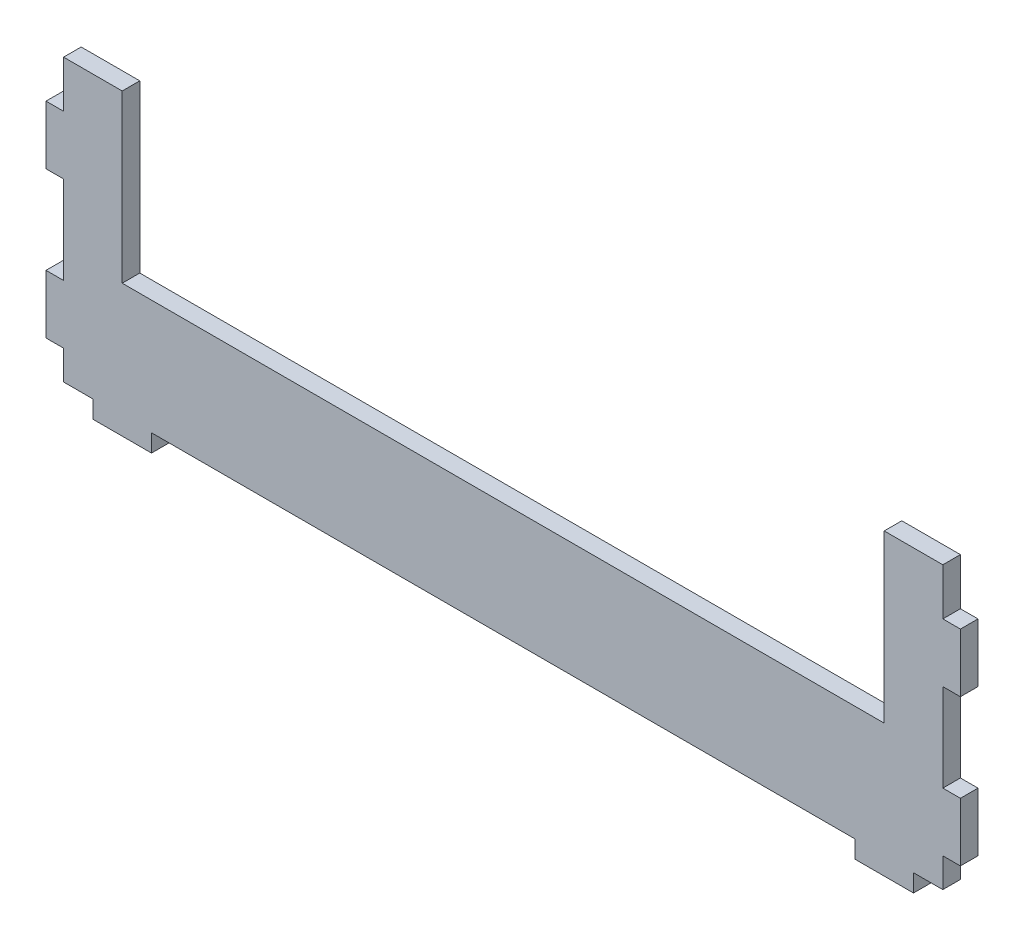
ISO-10303-21;
HEADER;
FILE_DESCRIPTION(('STEP AP214'),'2;1');
FILE_NAME('part.step','',(''),(''),'','','');
FILE_SCHEMA(('AUTOMOTIVE_DESIGN { 1 0 10303 214 1 1 1 1 }'));
ENDSEC;
DATA;
#1=APPLICATION_CONTEXT('core data for automotive mechanical design processes');
#2=APPLICATION_PROTOCOL_DEFINITION('international standard','automotive_design',2000,#1);
#3=PRODUCT_CONTEXT('',#1,'mechanical');
#4=PRODUCT('Part','Part','',(#3));
#5=PRODUCT_RELATED_PRODUCT_CATEGORY('part','',(#4));
#6=PRODUCT_DEFINITION_FORMATION('','',#4);
#7=PRODUCT_DEFINITION_CONTEXT('part definition',#1,'design');
#8=PRODUCT_DEFINITION('design','',#6,#7);
#9=PRODUCT_DEFINITION_SHAPE('','',#8);
#10=(LENGTH_UNIT() NAMED_UNIT(*) SI_UNIT(.MILLI.,.METRE.));
#11=(NAMED_UNIT(*) PLANE_ANGLE_UNIT() SI_UNIT($,.RADIAN.));
#12=(NAMED_UNIT(*) SI_UNIT($,.STERADIAN.) SOLID_ANGLE_UNIT());
#13=UNCERTAINTY_MEASURE_WITH_UNIT(LENGTH_MEASURE(1.E-05),#10,'distance_accuracy_value','');
#14=(GEOMETRIC_REPRESENTATION_CONTEXT(3) GLOBAL_UNCERTAINTY_ASSIGNED_CONTEXT((#13)) GLOBAL_UNIT_ASSIGNED_CONTEXT((#10,
#11,#12)) REPRESENTATION_CONTEXT('',''));
#15=CARTESIAN_POINT('',(0.,0.,0.));
#16=DIRECTION('',(0.,0.,1.));
#17=DIRECTION('',(1.,0.,0.));
#18=AXIS2_PLACEMENT_3D('',#15,#16,#17);
#19=CARTESIAN_POINT('',(0.,0.,0.));
#20=DIRECTION('',(0.,0.,-1.));
#21=DIRECTION('',(-1.,0.,0.));
#22=AXIS2_PLACEMENT_3D('',#19,#20,#21);
#23=PLANE('',#22);
#24=DIRECTION('',(0.,-1.,0.));
#25=VECTOR('',#24,1.);
#26=CARTESIAN_POINT('',(-495.568859933218,5.99999999999858,0.));
#27=LINE('',#26,#25);
#28=CARTESIAN_POINT('',(-495.568859933218,15.9999999984444,0.));
#29=VERTEX_POINT('',#28);
#30=CARTESIAN_POINT('',(-495.568859933218,5.99999999999858,0.));
#31=VERTEX_POINT('',#30);
#32=EDGE_CURVE('E253',#29,#31,#27,.T.);
#33=ORIENTED_EDGE('',*,*,#32,.F.);
#34=DIRECTION('',(1.,0.,0.));
#35=VECTOR('',#34,1.);
#36=CARTESIAN_POINT('',(-501.568859933218,15.9999999984444,0.));
#37=LINE('',#36,#35);
#38=CARTESIAN_POINT('',(-501.568859933218,15.9999999984444,0.));
#39=VERTEX_POINT('',#38);
#40=EDGE_CURVE('E349',#39,#29,#37,.T.);
#41=ORIENTED_EDGE('',*,*,#40,.F.);
#42=DIRECTION('',(0.,-1.,0.));
#43=VECTOR('',#42,1.);
#44=CARTESIAN_POINT('',(-501.568859933218,35.9999999984444,0.));
#45=LINE('',#44,#43);
#46=CARTESIAN_POINT('',(-501.568859933218,35.9999999984444,0.));
#47=VERTEX_POINT('',#46);
#48=EDGE_CURVE('E346',#47,#39,#45,.T.);
#49=ORIENTED_EDGE('',*,*,#48,.F.);
#50=DIRECTION('',(-1.,0.,0.));
#51=VECTOR('',#50,1.);
#52=CARTESIAN_POINT('',(-495.568859933218,35.9999999984444,0.));
#53=LINE('',#52,#51);
#54=CARTESIAN_POINT('',(-495.568859933218,35.9999999984444,0.));
#55=VERTEX_POINT('',#54);
#56=EDGE_CURVE('E343',#55,#47,#53,.T.);
#57=ORIENTED_EDGE('',*,*,#56,.F.);
#58=DIRECTION('',(0.,-1.,0.));
#59=VECTOR('',#58,1.);
#60=CARTESIAN_POINT('',(-495.568859933218,35.9999999984444,0.));
#61=LINE('',#60,#59);
#62=CARTESIAN_POINT('',(-495.568859933218,65.9999999984442,0.));
#63=VERTEX_POINT('',#62);
#64=EDGE_CURVE('E340',#63,#55,#61,.T.);
#65=ORIENTED_EDGE('',*,*,#64,.F.);
#66=DIRECTION('',(1.,0.,0.));
#67=VECTOR('',#66,1.);
#68=CARTESIAN_POINT('',(-501.568859933218,65.9999999984442,0.));
#69=LINE('',#68,#67);
#70=CARTESIAN_POINT('',(-501.568859933218,65.9999999984442,0.));
#71=VERTEX_POINT('',#70);
#72=EDGE_CURVE('E337',#71,#63,#69,.T.);
#73=ORIENTED_EDGE('',*,*,#72,.F.);
#74=DIRECTION('',(0.,-1.,0.));
#75=VECTOR('',#74,1.);
#76=CARTESIAN_POINT('',(-501.568859933218,85.9999999984442,0.));
#77=LINE('',#76,#75);
#78=CARTESIAN_POINT('',(-501.568859933218,85.9999999984442,0.));
#79=VERTEX_POINT('',#78);
#80=EDGE_CURVE('E334',#79,#71,#77,.T.);
#81=ORIENTED_EDGE('',*,*,#80,.F.);
#82=DIRECTION('',(-1.,0.,0.));
#83=VECTOR('',#82,1.);
#84=CARTESIAN_POINT('',(-495.568859933218,85.9999999984442,0.));
#85=LINE('',#84,#83);
#86=CARTESIAN_POINT('',(-495.568859933218,85.9999999984442,0.));
#87=VERTEX_POINT('',#86);
#88=EDGE_CURVE('E331',#87,#79,#85,.T.);
#89=ORIENTED_EDGE('',*,*,#88,.F.);
#90=DIRECTION('',(0.,-1.,0.));
#91=VECTOR('',#90,1.);
#92=CARTESIAN_POINT('',(-495.568859933218,85.9999999984442,0.));
#93=LINE('',#92,#91);
#94=CARTESIAN_POINT('',(-495.568859933218,102.000000000001,0.));
#95=VERTEX_POINT('',#94);
#96=EDGE_CURVE('E328',#95,#87,#93,.T.);
#97=ORIENTED_EDGE('',*,*,#96,.F.);
#98=DIRECTION('',(-1.,0.,0.));
#99=VECTOR('',#98,1.);
#100=CARTESIAN_POINT('',(-495.568859933218,102.000000000001,0.));
#101=LINE('',#100,#99);
#102=CARTESIAN_POINT('',(-475.568859933233,102.,0.));
#103=VERTEX_POINT('',#102);
#104=EDGE_CURVE('E325',#103,#95,#101,.T.);
#105=ORIENTED_EDGE('',*,*,#104,.F.);
#106=DIRECTION('',(0.,1.,0.));
#107=VECTOR('',#106,1.);
#108=CARTESIAN_POINT('',(-475.568859933233,102.,0.));
#109=LINE('',#108,#107);
#110=CARTESIAN_POINT('',(-475.568859933233,45.1999999999997,0.));
#111=VERTEX_POINT('',#110);
#112=EDGE_CURVE('E322',#111,#103,#109,.T.);
#113=ORIENTED_EDGE('',*,*,#112,.F.);
#114=DIRECTION('',(-1.,0.,0.));
#115=VECTOR('',#114,1.);
#116=CARTESIAN_POINT('',(-475.568859933233,45.1999999999997,0.));
#117=LINE('',#116,#115);
#118=CARTESIAN_POINT('',(-215.568859933231,45.2000000000004,0.));
#119=VERTEX_POINT('',#118);
#120=EDGE_CURVE('E319',#119,#111,#117,.T.);
#121=ORIENTED_EDGE('',*,*,#120,.F.);
#122=DIRECTION('',(0.,-1.,0.));
#123=VECTOR('',#122,1.);
#124=CARTESIAN_POINT('',(-215.568859933231,102.000000000001,0.));
#125=LINE('',#124,#123);
#126=CARTESIAN_POINT('',(-215.568859933231,102.000000000001,0.));
#127=VERTEX_POINT('',#126);
#128=EDGE_CURVE('E316',#127,#119,#125,.T.);
#129=ORIENTED_EDGE('',*,*,#128,.F.);
#130=DIRECTION('',(-1.,0.,0.));
#131=VECTOR('',#130,1.);
#132=CARTESIAN_POINT('',(-215.568859933231,102.000000000001,0.));
#133=LINE('',#132,#131);
#134=CARTESIAN_POINT('',(-195.568859933246,102.,0.));
#135=VERTEX_POINT('',#134);
#136=EDGE_CURVE('E313',#135,#127,#133,.T.);
#137=ORIENTED_EDGE('',*,*,#136,.F.);
#138=DIRECTION('',(0.,1.,0.));
#139=VECTOR('',#138,1.);
#140=CARTESIAN_POINT('',(-195.568859933246,86.0000000000003,0.));
#141=LINE('',#140,#139);
#142=CARTESIAN_POINT('',(-195.568859933246,86.0000000000003,0.));
#143=VERTEX_POINT('',#142);
#144=EDGE_CURVE('E310',#143,#135,#141,.T.);
#145=ORIENTED_EDGE('',*,*,#144,.F.);
#146=DIRECTION('',(-1.,0.,0.));
#147=VECTOR('',#146,1.);
#148=CARTESIAN_POINT('',(-189.568859933246,86.0000000000003,0.));
#149=LINE('',#148,#147);
#150=CARTESIAN_POINT('',(-189.568859933246,86.0000000000003,0.));
#151=VERTEX_POINT('',#150);
#152=EDGE_CURVE('E307',#151,#143,#149,.T.);
#153=ORIENTED_EDGE('',*,*,#152,.F.);
#154=DIRECTION('',(0.,1.,0.));
#155=VECTOR('',#154,1.);
#156=CARTESIAN_POINT('',(-189.568859933246,66.0000000000003,0.));
#157=LINE('',#156,#155);
#158=CARTESIAN_POINT('',(-189.568859933246,66.0000000000003,0.));
#159=VERTEX_POINT('',#158);
#160=EDGE_CURVE('E304',#159,#151,#157,.T.);
#161=ORIENTED_EDGE('',*,*,#160,.F.);
#162=DIRECTION('',(1.,0.,0.));
#163=VECTOR('',#162,1.);
#164=CARTESIAN_POINT('',(-195.568859933246,66.0000000000003,0.));
#165=LINE('',#164,#163);
#166=CARTESIAN_POINT('',(-195.568859933246,66.0000000000003,0.));
#167=VERTEX_POINT('',#166);
#168=EDGE_CURVE('E301',#167,#159,#165,.T.);
#169=ORIENTED_EDGE('',*,*,#168,.F.);
#170=DIRECTION('',(0.,1.,0.));
#171=VECTOR('',#170,1.);
#172=CARTESIAN_POINT('',(-195.568859933246,36.0000000000005,0.));
#173=LINE('',#172,#171);
#174=CARTESIAN_POINT('',(-195.568859933246,36.0000000000005,0.));
#175=VERTEX_POINT('',#174);
#176=EDGE_CURVE('E298',#175,#167,#173,.T.);
#177=ORIENTED_EDGE('',*,*,#176,.F.);
#178=DIRECTION('',(-1.,0.,0.));
#179=VECTOR('',#178,1.);
#180=CARTESIAN_POINT('',(-189.568859933246,36.0000000000005,0.));
#181=LINE('',#180,#179);
#182=CARTESIAN_POINT('',(-189.568859933246,36.0000000000005,0.));
#183=VERTEX_POINT('',#182);
#184=EDGE_CURVE('E295',#183,#175,#181,.T.);
#185=ORIENTED_EDGE('',*,*,#184,.F.);
#186=DIRECTION('',(0.,1.,0.));
#187=VECTOR('',#186,1.);
#188=CARTESIAN_POINT('',(-189.568859933246,16.0000000000005,0.));
#189=LINE('',#188,#187);
#190=CARTESIAN_POINT('',(-189.568859933246,16.0000000000005,0.));
#191=VERTEX_POINT('',#190);
#192=EDGE_CURVE('E292',#191,#183,#189,.T.);
#193=ORIENTED_EDGE('',*,*,#192,.F.);
#194=DIRECTION('',(1.,0.,0.));
#195=VECTOR('',#194,1.);
#196=CARTESIAN_POINT('',(-195.568859933246,16.0000000000005,0.));
#197=LINE('',#196,#195);
#198=CARTESIAN_POINT('',(-195.568859933246,16.0000000000005,0.));
#199=VERTEX_POINT('',#198);
#200=EDGE_CURVE('E289',#199,#191,#197,.T.);
#201=ORIENTED_EDGE('',*,*,#200,.F.);
#202=DIRECTION('',(0.,1.,0.));
#203=VECTOR('',#202,1.);
#204=CARTESIAN_POINT('',(-195.568859933246,5.99999999999858,0.));
#205=LINE('',#204,#203);
#206=CARTESIAN_POINT('',(-195.568859933246,5.99999999999858,0.));
#207=VERTEX_POINT('',#206);
#208=EDGE_CURVE('E286',#207,#199,#205,.T.);
#209=ORIENTED_EDGE('',*,*,#208,.F.);
#210=DIRECTION('',(1.,-2.08773970333809E-13,0.));
#211=VECTOR('',#210,1.);
#212=CARTESIAN_POINT('',(-205.568859933246,6.00000000000067,0.));
#213=LINE('',#212,#211);
#214=CARTESIAN_POINT('',(-205.568859933246,6.00000000000067,0.));
#215=VERTEX_POINT('',#214);
#216=EDGE_CURVE('E283',#215,#207,#213,.T.);
#217=ORIENTED_EDGE('',*,*,#216,.F.);
#218=DIRECTION('',(0.,1.,0.));
#219=VECTOR('',#218,1.);
#220=CARTESIAN_POINT('',(-205.568859933246,6.67868538251071E-13,0.));
#221=LINE('',#220,#219);
#222=CARTESIAN_POINT('',(-205.568859933246,6.67868538251071E-13,0.));
#223=VERTEX_POINT('',#222);
#224=EDGE_CURVE('E280',#223,#215,#221,.T.);
#225=ORIENTED_EDGE('',*,*,#224,.F.);
#226=DIRECTION('',(1.,0.,0.));
#227=VECTOR('',#226,1.);
#228=CARTESIAN_POINT('',(-225.568859933246,6.73072708679001E-13,0.));
#229=LINE('',#228,#227);
#230=CARTESIAN_POINT('',(-225.568859933246,6.73072708679001E-13,0.));
#231=VERTEX_POINT('',#230);
#232=EDGE_CURVE('E277',#231,#223,#229,.T.);
#233=ORIENTED_EDGE('',*,*,#232,.F.);
#234=DIRECTION('',(0.,-1.,0.));
#235=VECTOR('',#234,1.);
#236=CARTESIAN_POINT('',(-225.568859933246,6.00000000000067,0.));
#237=LINE('',#236,#235);
#238=CARTESIAN_POINT('',(-225.568859933246,6.00000000000067,0.));
#239=VERTEX_POINT('',#238);
#240=EDGE_CURVE('E274',#239,#231,#237,.T.);
#241=ORIENTED_EDGE('',*,*,#240,.F.);
#242=DIRECTION('',(1.,0.,0.));
#243=VECTOR('',#242,1.);
#244=CARTESIAN_POINT('',(-465.568859933219,5.99999999999859,0.));
#245=LINE('',#244,#243);
#246=CARTESIAN_POINT('',(-465.568859933219,5.99999999999859,0.));
#247=VERTEX_POINT('',#246);
#248=EDGE_CURVE('E271',#247,#239,#245,.T.);
#249=ORIENTED_EDGE('',*,*,#248,.F.);
#250=DIRECTION('',(0.,1.,0.));
#251=VECTOR('',#250,1.);
#252=CARTESIAN_POINT('',(-465.568859933219,-1.41132195797604E-12,0.));
#253=LINE('',#252,#251);
#254=CARTESIAN_POINT('',(-465.568859933219,-1.41132195797604E-12,0.));
#255=VERTEX_POINT('',#254);
#256=EDGE_CURVE('E268',#255,#247,#253,.T.);
#257=ORIENTED_EDGE('',*,*,#256,.F.);
#258=DIRECTION('',(1.,0.,0.));
#259=VECTOR('',#258,1.);
#260=CARTESIAN_POINT('',(-485.568859933219,-1.40827684539151E-12,0.));
#261=LINE('',#260,#259);
#262=CARTESIAN_POINT('',(-485.568859933219,-1.40827684539151E-12,0.));
#263=VERTEX_POINT('',#262);
#264=EDGE_CURVE('E265',#263,#255,#261,.T.);
#265=ORIENTED_EDGE('',*,*,#264,.F.);
#266=DIRECTION('',(0.,-1.,0.));
#267=VECTOR('',#266,1.);
#268=CARTESIAN_POINT('',(-485.568859933219,5.99999999999859,0.));
#269=LINE('',#268,#267);
#270=CARTESIAN_POINT('',(-485.568859933219,5.99999999999859,0.));
#271=VERTEX_POINT('',#270);
#272=EDGE_CURVE('E256',#271,#263,#269,.T.);
#273=ORIENTED_EDGE('',*,*,#272,.F.);
#274=DIRECTION('',(1.,0.,0.));
#275=VECTOR('',#274,1.);
#276=CARTESIAN_POINT('',(-495.568859933218,5.99999999999858,0.));
#277=LINE('',#276,#275);
#278=EDGE_CURVE('E245',#31,#271,#277,.T.);
#279=ORIENTED_EDGE('',*,*,#278,.F.);
#280=EDGE_LOOP('',(#33,#41,#49,#57,#65,#73,#81,#89,#97,#105,#113,#121,#129,#137,#145,#153,#161,
#169,#177,#185,#193,#201,#209,#217,#225,#233,#241,#249,#257,#265,#273,#279));
#281=FACE_BOUND('',#280,.T.);
#282=ADVANCED_FACE('F33',(#281),#23,.T.);
#283=CARTESIAN_POINT('',(-501.568859933218,15.9999999984444,334.249904798169));
#284=DIRECTION('',(0.,1.,0.));
#285=DIRECTION('',(0.,0.,1.));
#286=AXIS2_PLACEMENT_3D('',#283,#284,#285);
#287=PLANE('',#286);
#288=DIRECTION('',(0.,0.,-1.));
#289=VECTOR('',#288,1.);
#290=CARTESIAN_POINT('',(-495.568859933218,15.9999999984444,334.249904798169));
#291=LINE('',#290,#289);
#292=CARTESIAN_POINT('',(-495.568859933218,15.9999999984444,5.99999999977509));
#293=VERTEX_POINT('',#292);
#294=EDGE_CURVE('E259',#293,#29,#291,.T.);
#295=ORIENTED_EDGE('',*,*,#294,.F.);
#296=DIRECTION('',(-1.,0.,0.));
#297=VECTOR('',#296,1.);
#298=CARTESIAN_POINT('',(-501.568859933214,15.9999999984444,5.99999999977502));
#299=LINE('',#298,#297);
#300=CARTESIAN_POINT('',(-501.568859933218,15.9999999984444,5.99999999977507));
#301=VERTEX_POINT('',#300);
#302=EDGE_CURVE('E37',#293,#301,#299,.T.);
#303=ORIENTED_EDGE('',*,*,#302,.T.);
#304=DIRECTION('',(0.,0.,-1.));
#305=VECTOR('',#304,1.);
#306=CARTESIAN_POINT('',(-501.568859933218,15.9999999984444,334.249904798169));
#307=LINE('',#306,#305);
#308=EDGE_CURVE('E352',#301,#39,#307,.T.);
#309=ORIENTED_EDGE('',*,*,#308,.T.);
#310=ORIENTED_EDGE('',*,*,#40,.T.);
#311=EDGE_LOOP('',(#295,#303,#309,#310));
#312=FACE_BOUND('',#311,.T.);
#313=ADVANCED_FACE('F501',(#312),#287,.F.);
#314=CARTESIAN_POINT('',(-501.568859933218,35.9999999984444,334.249904798169));
#315=DIRECTION('',(1.,0.,0.));
#316=DIRECTION('',(0.,0.,-1.));
#317=AXIS2_PLACEMENT_3D('',#314,#315,#316);
#318=PLANE('',#317);
#319=ORIENTED_EDGE('',*,*,#308,.F.);
#320=DIRECTION('',(0.,1.,7.41508533756195E-12));
#321=VECTOR('',#320,1.);
#322=CARTESIAN_POINT('',(-501.568859933218,36.0000000008784,5.99999999992334));
#323=LINE('',#322,#321);
#324=CARTESIAN_POINT('',(-501.568859933218,35.9999999984444,5.99999999992334));
#325=VERTEX_POINT('',#324);
#326=EDGE_CURVE('E495',#301,#325,#323,.T.);
#327=ORIENTED_EDGE('',*,*,#326,.T.);
#328=DIRECTION('',(0.,0.,-1.));
#329=VECTOR('',#328,1.);
#330=CARTESIAN_POINT('',(-501.568859933218,35.9999999984444,334.249904798169));
#331=LINE('',#330,#329);
#332=EDGE_CURVE('E354',#325,#47,#331,.T.);
#333=ORIENTED_EDGE('',*,*,#332,.T.);
#334=ORIENTED_EDGE('',*,*,#48,.T.);
#335=EDGE_LOOP('',(#319,#327,#333,#334));
#336=FACE_BOUND('',#335,.T.);
#337=ADVANCED_FACE('F504',(#336),#318,.F.);
#338=CARTESIAN_POINT('',(-495.568859933218,35.9999999984444,334.249904798169));
#339=DIRECTION('',(0.,-1.,0.));
#340=DIRECTION('',(0.,0.,-1.));
#341=AXIS2_PLACEMENT_3D('',#338,#339,#340);
#342=PLANE('',#341);
#343=ORIENTED_EDGE('',*,*,#332,.F.);
#344=DIRECTION('',(1.,0.,0.));
#345=VECTOR('',#344,1.);
#346=CARTESIAN_POINT('',(-495.568859933214,35.9999999984444,5.9999999999234));
#347=LINE('',#346,#345);
#348=CARTESIAN_POINT('',(-495.568859933218,35.9999999984444,5.9999999999234));
#349=VERTEX_POINT('',#348);
#350=EDGE_CURVE('E492',#325,#349,#347,.T.);
#351=ORIENTED_EDGE('',*,*,#350,.T.);
#352=DIRECTION('',(0.,0.,-1.));
#353=VECTOR('',#352,1.);
#354=CARTESIAN_POINT('',(-495.568859933218,35.9999999984444,334.249904798169));
#355=LINE('',#354,#353);
#356=EDGE_CURVE('E356',#349,#55,#355,.T.);
#357=ORIENTED_EDGE('',*,*,#356,.T.);
#358=ORIENTED_EDGE('',*,*,#56,.T.);
#359=EDGE_LOOP('',(#343,#351,#357,#358));
#360=FACE_BOUND('',#359,.T.);
#361=ADVANCED_FACE('F510',(#360),#342,.F.);
#362=CARTESIAN_POINT('',(-495.568859933218,35.9999999984444,334.249904798169));
#363=DIRECTION('',(1.,0.,0.));
#364=DIRECTION('',(0.,0.,-1.));
#365=AXIS2_PLACEMENT_3D('',#362,#363,#364);
#366=PLANE('',#365);
#367=ORIENTED_EDGE('',*,*,#356,.F.);
#368=DIRECTION('',(0.,1.,7.41508533756195E-12));
#369=VECTOR('',#368,1.);
#370=CARTESIAN_POINT('',(-495.568859933218,36.0000000008784,5.9999999999234));
#371=LINE('',#370,#369);
#372=CARTESIAN_POINT('',(-495.568859933218,65.9999999984442,6.00000000014585));
#373=VERTEX_POINT('',#372);
#374=EDGE_CURVE('E489',#349,#373,#371,.T.);
#375=ORIENTED_EDGE('',*,*,#374,.T.);
#376=DIRECTION('',(0.,0.,-1.));
#377=VECTOR('',#376,1.);
#378=CARTESIAN_POINT('',(-495.568859933218,65.9999999984442,334.249904798169));
#379=LINE('',#378,#377);
#380=EDGE_CURVE('E358',#373,#63,#379,.T.);
#381=ORIENTED_EDGE('',*,*,#380,.T.);
#382=ORIENTED_EDGE('',*,*,#64,.T.);
#383=EDGE_LOOP('',(#367,#375,#381,#382));
#384=FACE_BOUND('',#383,.T.);
#385=ADVANCED_FACE('F513',(#384),#366,.F.);
#386=CARTESIAN_POINT('',(-501.568859933218,65.9999999984442,334.249904798169));
#387=DIRECTION('',(0.,1.,0.));
#388=DIRECTION('',(0.,0.,1.));
#389=AXIS2_PLACEMENT_3D('',#386,#387,#388);
#390=PLANE('',#389);
#391=ORIENTED_EDGE('',*,*,#380,.F.);
#392=DIRECTION('',(-1.,0.,0.));
#393=VECTOR('',#392,1.);
#394=CARTESIAN_POINT('',(-501.568859933214,65.9999999984442,6.00000000014578));
#395=LINE('',#394,#393);
#396=CARTESIAN_POINT('',(-501.568859933218,65.9999999984442,6.00000000014578));
#397=VERTEX_POINT('',#396);
#398=EDGE_CURVE('E486',#373,#397,#395,.T.);
#399=ORIENTED_EDGE('',*,*,#398,.T.);
#400=DIRECTION('',(0.,0.,-1.));
#401=VECTOR('',#400,1.);
#402=CARTESIAN_POINT('',(-501.568859933218,65.9999999984442,334.249904798169));
#403=LINE('',#402,#401);
#404=EDGE_CURVE('E360',#397,#71,#403,.T.);
#405=ORIENTED_EDGE('',*,*,#404,.T.);
#406=ORIENTED_EDGE('',*,*,#72,.T.);
#407=EDGE_LOOP('',(#391,#399,#405,#406));
#408=FACE_BOUND('',#407,.T.);
#409=ADVANCED_FACE('F516',(#408),#390,.F.);
#410=CARTESIAN_POINT('',(-501.568859933218,85.9999999984442,334.249904798169));
#411=DIRECTION('',(1.,0.,0.));
#412=DIRECTION('',(0.,0.,-1.));
#413=AXIS2_PLACEMENT_3D('',#410,#411,#412);
#414=PLANE('',#413);
#415=ORIENTED_EDGE('',*,*,#404,.F.);
#416=DIRECTION('',(0.,1.,7.41508533756195E-12));
#417=VECTOR('',#416,1.);
#418=CARTESIAN_POINT('',(-501.568859933218,86.0000000008782,6.0000000002941));
#419=LINE('',#418,#417);
#420=CARTESIAN_POINT('',(-501.568859933218,85.9999999984442,6.0000000002941));
#421=VERTEX_POINT('',#420);
#422=EDGE_CURVE('E483',#397,#421,#419,.T.);
#423=ORIENTED_EDGE('',*,*,#422,.T.);
#424=DIRECTION('',(0.,0.,-1.));
#425=VECTOR('',#424,1.);
#426=CARTESIAN_POINT('',(-501.568859933218,85.9999999984442,334.249904798169));
#427=LINE('',#426,#425);
#428=EDGE_CURVE('E362',#421,#79,#427,.T.);
#429=ORIENTED_EDGE('',*,*,#428,.T.);
#430=ORIENTED_EDGE('',*,*,#80,.T.);
#431=EDGE_LOOP('',(#415,#423,#429,#430));
#432=FACE_BOUND('',#431,.T.);
#433=ADVANCED_FACE('F522',(#432),#414,.F.);
#434=CARTESIAN_POINT('',(-495.568859933218,85.9999999984442,334.249904798169));
#435=DIRECTION('',(0.,-1.,0.));
#436=DIRECTION('',(0.,0.,-1.));
#437=AXIS2_PLACEMENT_3D('',#434,#435,#436);
#438=PLANE('',#437);
#439=ORIENTED_EDGE('',*,*,#428,.F.);
#440=DIRECTION('',(1.,0.,0.));
#441=VECTOR('',#440,1.);
#442=CARTESIAN_POINT('',(-495.568859933214,85.9999999984442,6.00000000029416));
#443=LINE('',#442,#441);
#444=CARTESIAN_POINT('',(-495.568859933218,85.9999999984442,6.00000000029416));
#445=VERTEX_POINT('',#444);
#446=EDGE_CURVE('E480',#421,#445,#443,.T.);
#447=ORIENTED_EDGE('',*,*,#446,.T.);
#448=DIRECTION('',(0.,0.,-1.));
#449=VECTOR('',#448,1.);
#450=CARTESIAN_POINT('',(-495.568859933218,85.9999999984442,334.249904798169));
#451=LINE('',#450,#449);
#452=EDGE_CURVE('E364',#445,#87,#451,.T.);
#453=ORIENTED_EDGE('',*,*,#452,.T.);
#454=ORIENTED_EDGE('',*,*,#88,.T.);
#455=EDGE_LOOP('',(#439,#447,#453,#454));
#456=FACE_BOUND('',#455,.T.);
#457=ADVANCED_FACE('F525',(#456),#438,.F.);
#458=CARTESIAN_POINT('',(-495.568859933218,85.9999999984442,334.249904798169));
#459=DIRECTION('',(1.,0.,0.));
#460=DIRECTION('',(0.,1.,0.));
#461=AXIS2_PLACEMENT_3D('',#458,#459,#460);
#462=PLANE('',#461);
#463=ORIENTED_EDGE('',*,*,#452,.F.);
#464=DIRECTION('',(0.,1.,7.41508533756195E-12));
#465=VECTOR('',#464,1.);
#466=CARTESIAN_POINT('',(-495.568859933218,86.0000000008782,6.00000000029416));
#467=LINE('',#466,#465);
#468=CARTESIAN_POINT('',(-495.568859933218,102.000000000001,6.0000000004128));
#469=VERTEX_POINT('',#468);
#470=EDGE_CURVE('E477',#445,#469,#467,.T.);
#471=ORIENTED_EDGE('',*,*,#470,.T.);
#472=DIRECTION('',(0.,0.,-1.));
#473=VECTOR('',#472,1.);
#474=CARTESIAN_POINT('',(-495.568859933218,102.000000000001,334.249904798169));
#475=LINE('',#474,#473);
#476=EDGE_CURVE('E366',#469,#95,#475,.T.);
#477=ORIENTED_EDGE('',*,*,#476,.T.);
#478=ORIENTED_EDGE('',*,*,#96,.T.);
#479=EDGE_LOOP('',(#463,#471,#477,#478));
#480=FACE_BOUND('',#479,.T.);
#481=ADVANCED_FACE('F528',(#480),#462,.F.);
#482=CARTESIAN_POINT('',(-495.568859933218,102.000000000001,334.249904798169));
#483=DIRECTION('',(0.,-1.,0.));
#484=DIRECTION('',(1.,0.,0.));
#485=AXIS2_PLACEMENT_3D('',#482,#483,#484);
#486=PLANE('',#485);
#487=ORIENTED_EDGE('',*,*,#476,.F.);
#488=DIRECTION('',(1.,0.,0.));
#489=VECTOR('',#488,1.);
#490=CARTESIAN_POINT('',(-495.568859933214,102.000000000001,6.00000000041279));
#491=LINE('',#490,#489);
#492=CARTESIAN_POINT('',(-475.568859933233,102.,6.00000000041303));
#493=VERTEX_POINT('',#492);
#494=EDGE_CURVE('E474',#469,#493,#491,.T.);
#495=ORIENTED_EDGE('',*,*,#494,.T.);
#496=DIRECTION('',(0.,0.,-1.));
#497=VECTOR('',#496,1.);
#498=CARTESIAN_POINT('',(-475.568859933233,102.,334.249904798169));
#499=LINE('',#498,#497);
#500=EDGE_CURVE('E368',#493,#103,#499,.T.);
#501=ORIENTED_EDGE('',*,*,#500,.T.);
#502=ORIENTED_EDGE('',*,*,#104,.T.);
#503=EDGE_LOOP('',(#487,#495,#501,#502));
#504=FACE_BOUND('',#503,.T.);
#505=ADVANCED_FACE('F534',(#504),#486,.F.);
#506=CARTESIAN_POINT('',(-475.568859933233,102.,334.249904798169));
#507=DIRECTION('',(-1.,0.,0.));
#508=DIRECTION('',(0.,0.,1.));
#509=AXIS2_PLACEMENT_3D('',#506,#507,#508);
#510=PLANE('',#509);
#511=ORIENTED_EDGE('',*,*,#500,.F.);
#512=DIRECTION('',(0.,-1.,-7.41508533756195E-12));
#513=VECTOR('',#512,1.);
#514=CARTESIAN_POINT('',(-475.568859933233,102.000000002434,6.00000000041306));
#515=LINE('',#514,#513);
#516=CARTESIAN_POINT('',(-475.568859933233,45.1999999999997,5.99999999999189));
#517=VERTEX_POINT('',#516);
#518=EDGE_CURVE('E471',#493,#517,#515,.T.);
#519=ORIENTED_EDGE('',*,*,#518,.T.);
#520=DIRECTION('',(0.,0.,-1.));
#521=VECTOR('',#520,1.);
#522=CARTESIAN_POINT('',(-475.568859933233,45.1999999999997,334.249904798169));
#523=LINE('',#522,#521);
#524=EDGE_CURVE('E370',#517,#111,#523,.T.);
#525=ORIENTED_EDGE('',*,*,#524,.T.);
#526=ORIENTED_EDGE('',*,*,#112,.T.);
#527=EDGE_LOOP('',(#511,#519,#525,#526));
#528=FACE_BOUND('',#527,.T.);
#529=ADVANCED_FACE('F537',(#528),#510,.F.);
#530=CARTESIAN_POINT('',(-475.568859933233,45.1999999999997,334.249904798169));
#531=DIRECTION('',(0.,-1.,0.));
#532=DIRECTION('',(1.,0.,0.));
#533=AXIS2_PLACEMENT_3D('',#530,#531,#532);
#534=PLANE('',#533);
#535=ORIENTED_EDGE('',*,*,#524,.F.);
#536=DIRECTION('',(1.,0.,0.));
#537=VECTOR('',#536,1.);
#538=CARTESIAN_POINT('',(-475.568859933229,45.1999999999997,5.99999999999184));
#539=LINE('',#538,#537);
#540=CARTESIAN_POINT('',(-215.568859933231,45.2000000000004,5.99999999999508));
#541=VERTEX_POINT('',#540);
#542=EDGE_CURVE('E468',#517,#541,#539,.T.);
#543=ORIENTED_EDGE('',*,*,#542,.T.);
#544=DIRECTION('',(0.,0.,-1.));
#545=VECTOR('',#544,1.);
#546=CARTESIAN_POINT('',(-215.568859933231,45.2000000000004,334.249904798169));
#547=LINE('',#546,#545);
#548=EDGE_CURVE('E372',#541,#119,#547,.T.);
#549=ORIENTED_EDGE('',*,*,#548,.T.);
#550=ORIENTED_EDGE('',*,*,#120,.T.);
#551=EDGE_LOOP('',(#535,#543,#549,#550));
#552=FACE_BOUND('',#551,.T.);
#553=ADVANCED_FACE('F540',(#552),#534,.F.);
#554=CARTESIAN_POINT('',(-215.568859933231,102.000000000001,334.249904798169));
#555=DIRECTION('',(1.,0.,0.));
#556=DIRECTION('',(0.,0.,-1.));
#557=AXIS2_PLACEMENT_3D('',#554,#555,#556);
#558=PLANE('',#557);
#559=ORIENTED_EDGE('',*,*,#548,.F.);
#560=DIRECTION('',(0.,1.,7.41508533756195E-12));
#561=VECTOR('',#560,1.);
#562=CARTESIAN_POINT('',(-215.568859933231,102.000000002435,6.00000000041628));
#563=LINE('',#562,#561);
#564=CARTESIAN_POINT('',(-215.568859933231,102.000000000001,6.00000000041628));
#565=VERTEX_POINT('',#564);
#566=EDGE_CURVE('E465',#541,#565,#563,.T.);
#567=ORIENTED_EDGE('',*,*,#566,.T.);
#568=DIRECTION('',(0.,0.,-1.));
#569=VECTOR('',#568,1.);
#570=CARTESIAN_POINT('',(-215.568859933231,102.000000000001,334.249904798169));
#571=LINE('',#570,#569);
#572=EDGE_CURVE('E374',#565,#127,#571,.T.);
#573=ORIENTED_EDGE('',*,*,#572,.T.);
#574=ORIENTED_EDGE('',*,*,#128,.T.);
#575=EDGE_LOOP('',(#559,#567,#573,#574));
#576=FACE_BOUND('',#575,.T.);
#577=ADVANCED_FACE('F546',(#576),#558,.F.);
#578=CARTESIAN_POINT('',(-215.568859933231,102.000000000001,334.249904798169));
#579=DIRECTION('',(0.,-1.,0.));
#580=DIRECTION('',(1.,0.,0.));
#581=AXIS2_PLACEMENT_3D('',#578,#579,#580);
#582=PLANE('',#581);
#583=ORIENTED_EDGE('',*,*,#572,.F.);
#584=DIRECTION('',(1.,0.,0.));
#585=VECTOR('',#584,1.);
#586=CARTESIAN_POINT('',(-215.568859933227,102.000000000001,6.00000000041628));
#587=LINE('',#586,#585);
#588=CARTESIAN_POINT('',(-195.568859933246,102.,6.00000000041653));
#589=VERTEX_POINT('',#588);
#590=EDGE_CURVE('E462',#565,#589,#587,.T.);
#591=ORIENTED_EDGE('',*,*,#590,.T.);
#592=DIRECTION('',(0.,0.,-1.));
#593=VECTOR('',#592,1.);
#594=CARTESIAN_POINT('',(-195.568859933246,102.,334.249904798169));
#595=LINE('',#594,#593);
#596=EDGE_CURVE('E376',#589,#135,#595,.T.);
#597=ORIENTED_EDGE('',*,*,#596,.T.);
#598=ORIENTED_EDGE('',*,*,#136,.T.);
#599=EDGE_LOOP('',(#583,#591,#597,#598));
#600=FACE_BOUND('',#599,.T.);
#601=ADVANCED_FACE('F549',(#600),#582,.F.);
#602=CARTESIAN_POINT('',(-195.568859933246,86.0000000000003,334.249904798169));
#603=DIRECTION('',(-1.,0.,0.));
#604=DIRECTION('',(0.,-1.,0.));
#605=AXIS2_PLACEMENT_3D('',#602,#603,#604);
#606=PLANE('',#605);
#607=ORIENTED_EDGE('',*,*,#596,.F.);
#608=DIRECTION('',(0.,-1.,-7.41508533756195E-12));
#609=VECTOR('',#608,1.);
#610=CARTESIAN_POINT('',(-195.568859933246,86.0000000024343,6.00000000029788));
#611=LINE('',#610,#609);
#612=CARTESIAN_POINT('',(-195.568859933246,86.0000000000003,6.00000000029788));
#613=VERTEX_POINT('',#612);
#614=EDGE_CURVE('E459',#589,#613,#611,.T.);
#615=ORIENTED_EDGE('',*,*,#614,.T.);
#616=DIRECTION('',(0.,0.,-1.));
#617=VECTOR('',#616,1.);
#618=CARTESIAN_POINT('',(-195.568859933246,86.0000000000003,334.249904798169));
#619=LINE('',#618,#617);
#620=EDGE_CURVE('E378',#613,#143,#619,.T.);
#621=ORIENTED_EDGE('',*,*,#620,.T.);
#622=ORIENTED_EDGE('',*,*,#144,.T.);
#623=EDGE_LOOP('',(#607,#615,#621,#622));
#624=FACE_BOUND('',#623,.T.);
#625=ADVANCED_FACE('F552',(#624),#606,.F.);
#626=CARTESIAN_POINT('',(-189.568859933246,86.0000000000003,334.249904798169));
#627=DIRECTION('',(0.,-1.,0.));
#628=DIRECTION('',(0.,0.,-1.));
#629=AXIS2_PLACEMENT_3D('',#626,#627,#628);
#630=PLANE('',#629);
#631=ORIENTED_EDGE('',*,*,#620,.F.);
#632=DIRECTION('',(1.,0.,0.));
#633=VECTOR('',#632,1.);
#634=CARTESIAN_POINT('',(-189.568859933242,86.0000000000003,6.00000000029799));
#635=LINE('',#634,#633);
#636=CARTESIAN_POINT('',(-189.568859933246,86.0000000000003,6.00000000029799));
#637=VERTEX_POINT('',#636);
#638=EDGE_CURVE('E456',#613,#637,#635,.T.);
#639=ORIENTED_EDGE('',*,*,#638,.T.);
#640=DIRECTION('',(0.,0.,-1.));
#641=VECTOR('',#640,1.);
#642=CARTESIAN_POINT('',(-189.568859933246,86.0000000000003,334.249904798169));
#643=LINE('',#642,#641);
#644=EDGE_CURVE('E380',#637,#151,#643,.T.);
#645=ORIENTED_EDGE('',*,*,#644,.T.);
#646=ORIENTED_EDGE('',*,*,#152,.T.);
#647=EDGE_LOOP('',(#631,#639,#645,#646));
#648=FACE_BOUND('',#647,.T.);
#649=ADVANCED_FACE('F558',(#648),#630,.F.);
#650=CARTESIAN_POINT('',(-189.568859933246,66.0000000000003,334.249904798169));
#651=DIRECTION('',(-1.,0.,0.));
#652=DIRECTION('',(0.,0.,1.));
#653=AXIS2_PLACEMENT_3D('',#650,#651,#652);
#654=PLANE('',#653);
#655=ORIENTED_EDGE('',*,*,#644,.F.);
#656=DIRECTION('',(0.,-1.,-7.41508533756195E-12));
#657=VECTOR('',#656,1.);
#658=CARTESIAN_POINT('',(-189.568859933246,66.0000000024343,6.00000000014966));
#659=LINE('',#658,#657);
#660=CARTESIAN_POINT('',(-189.568859933246,66.0000000000003,6.00000000014966));
#661=VERTEX_POINT('',#660);
#662=EDGE_CURVE('E453',#637,#661,#659,.T.);
#663=ORIENTED_EDGE('',*,*,#662,.T.);
#664=DIRECTION('',(0.,0.,-1.));
#665=VECTOR('',#664,1.);
#666=CARTESIAN_POINT('',(-189.568859933246,66.0000000000003,334.249904798169));
#667=LINE('',#666,#665);
#668=EDGE_CURVE('E382',#661,#159,#667,.T.);
#669=ORIENTED_EDGE('',*,*,#668,.T.);
#670=ORIENTED_EDGE('',*,*,#160,.T.);
#671=EDGE_LOOP('',(#655,#663,#669,#670));
#672=FACE_BOUND('',#671,.T.);
#673=ADVANCED_FACE('F561',(#672),#654,.F.);
#674=CARTESIAN_POINT('',(-195.568859933246,66.0000000000003,334.249904798169));
#675=DIRECTION('',(0.,1.,0.));
#676=DIRECTION('',(0.,0.,1.));
#677=AXIS2_PLACEMENT_3D('',#674,#675,#676);
#678=PLANE('',#677);
#679=ORIENTED_EDGE('',*,*,#668,.F.);
#680=DIRECTION('',(-1.,0.,0.));
#681=VECTOR('',#680,1.);
#682=CARTESIAN_POINT('',(-195.568859933242,66.0000000000003,6.00000000014961));
#683=LINE('',#682,#681);
#684=CARTESIAN_POINT('',(-195.568859933246,66.0000000000003,6.00000000014961));
#685=VERTEX_POINT('',#684);
#686=EDGE_CURVE('E450',#661,#685,#683,.T.);
#687=ORIENTED_EDGE('',*,*,#686,.T.);
#688=DIRECTION('',(0.,0.,-1.));
#689=VECTOR('',#688,1.);
#690=CARTESIAN_POINT('',(-195.568859933246,66.0000000000003,334.249904798169));
#691=LINE('',#690,#689);
#692=EDGE_CURVE('E384',#685,#167,#691,.T.);
#693=ORIENTED_EDGE('',*,*,#692,.T.);
#694=ORIENTED_EDGE('',*,*,#168,.T.);
#695=EDGE_LOOP('',(#679,#687,#693,#694));
#696=FACE_BOUND('',#695,.T.);
#697=ADVANCED_FACE('F564',(#696),#678,.F.);
#698=CARTESIAN_POINT('',(-195.568859933246,36.0000000000005,334.249904798169));
#699=DIRECTION('',(-1.,0.,0.));
#700=DIRECTION('',(0.,0.,1.));
#701=AXIS2_PLACEMENT_3D('',#698,#699,#700);
#702=PLANE('',#701);
#703=ORIENTED_EDGE('',*,*,#692,.F.);
#704=DIRECTION('',(0.,-1.,-7.41508533756195E-12));
#705=VECTOR('',#704,1.);
#706=CARTESIAN_POINT('',(-195.568859933246,36.0000000024345,5.99999999992712));
#707=LINE('',#706,#705);
#708=CARTESIAN_POINT('',(-195.568859933246,36.0000000000005,5.99999999992712));
#709=VERTEX_POINT('',#708);
#710=EDGE_CURVE('E447',#685,#709,#707,.T.);
#711=ORIENTED_EDGE('',*,*,#710,.T.);
#712=DIRECTION('',(0.,0.,-1.));
#713=VECTOR('',#712,1.);
#714=CARTESIAN_POINT('',(-195.568859933246,36.0000000000005,334.249904798169));
#715=LINE('',#714,#713);
#716=EDGE_CURVE('E386',#709,#175,#715,.T.);
#717=ORIENTED_EDGE('',*,*,#716,.T.);
#718=ORIENTED_EDGE('',*,*,#176,.T.);
#719=EDGE_LOOP('',(#703,#711,#717,#718));
#720=FACE_BOUND('',#719,.T.);
#721=ADVANCED_FACE('F570',(#720),#702,.F.);
#722=CARTESIAN_POINT('',(-189.568859933246,36.0000000000005,334.249904798169));
#723=DIRECTION('',(0.,-1.,0.));
#724=DIRECTION('',(0.,0.,-1.));
#725=AXIS2_PLACEMENT_3D('',#722,#723,#724);
#726=PLANE('',#725);
#727=ORIENTED_EDGE('',*,*,#716,.F.);
#728=DIRECTION('',(1.,0.,0.));
#729=VECTOR('',#728,1.);
#730=CARTESIAN_POINT('',(-189.568859933242,36.0000000000005,5.99999999992723));
#731=LINE('',#730,#729);
#732=CARTESIAN_POINT('',(-189.568859933246,36.0000000000005,5.99999999992723));
#733=VERTEX_POINT('',#732);
#734=EDGE_CURVE('E444',#709,#733,#731,.T.);
#735=ORIENTED_EDGE('',*,*,#734,.T.);
#736=DIRECTION('',(0.,0.,-1.));
#737=VECTOR('',#736,1.);
#738=CARTESIAN_POINT('',(-189.568859933246,36.0000000000005,334.249904798169));
#739=LINE('',#738,#737);
#740=EDGE_CURVE('E388',#733,#183,#739,.T.);
#741=ORIENTED_EDGE('',*,*,#740,.T.);
#742=ORIENTED_EDGE('',*,*,#184,.T.);
#743=EDGE_LOOP('',(#727,#735,#741,#742));
#744=FACE_BOUND('',#743,.T.);
#745=ADVANCED_FACE('F573',(#744),#726,.F.);
#746=CARTESIAN_POINT('',(-189.568859933246,16.0000000000005,334.249904798169));
#747=DIRECTION('',(-1.,0.,0.));
#748=DIRECTION('',(0.,-1.,0.));
#749=AXIS2_PLACEMENT_3D('',#746,#747,#748);
#750=PLANE('',#749);
#751=ORIENTED_EDGE('',*,*,#740,.F.);
#752=DIRECTION('',(0.,-1.,-7.41508533756195E-12));
#753=VECTOR('',#752,1.);
#754=CARTESIAN_POINT('',(-189.568859933246,16.0000000024345,5.9999999997789));
#755=LINE('',#754,#753);
#756=CARTESIAN_POINT('',(-189.568859933246,16.0000000000005,5.9999999997789));
#757=VERTEX_POINT('',#756);
#758=EDGE_CURVE('E441',#733,#757,#755,.T.);
#759=ORIENTED_EDGE('',*,*,#758,.T.);
#760=DIRECTION('',(0.,0.,-1.));
#761=VECTOR('',#760,1.);
#762=CARTESIAN_POINT('',(-189.568859933246,16.0000000000005,334.249904798169));
#763=LINE('',#762,#761);
#764=EDGE_CURVE('E390',#757,#191,#763,.T.);
#765=ORIENTED_EDGE('',*,*,#764,.T.);
#766=ORIENTED_EDGE('',*,*,#192,.T.);
#767=EDGE_LOOP('',(#751,#759,#765,#766));
#768=FACE_BOUND('',#767,.T.);
#769=ADVANCED_FACE('F576',(#768),#750,.F.);
#770=CARTESIAN_POINT('',(-195.568859933246,16.0000000000005,334.249904798169));
#771=DIRECTION('',(0.,1.,0.));
#772=DIRECTION('',(0.,0.,1.));
#773=AXIS2_PLACEMENT_3D('',#770,#771,#772);
#774=PLANE('',#773);
#775=ORIENTED_EDGE('',*,*,#764,.F.);
#776=DIRECTION('',(-1.,0.,0.));
#777=VECTOR('',#776,1.);
#778=CARTESIAN_POINT('',(-195.568859933242,16.0000000000005,5.99999999977885));
#779=LINE('',#778,#777);
#780=CARTESIAN_POINT('',(-195.568859933246,16.0000000000005,5.99999999977885));
#781=VERTEX_POINT('',#780);
#782=EDGE_CURVE('E438',#757,#781,#779,.T.);
#783=ORIENTED_EDGE('',*,*,#782,.T.);
#784=DIRECTION('',(0.,0.,-1.));
#785=VECTOR('',#784,1.);
#786=CARTESIAN_POINT('',(-195.568859933246,16.0000000000005,334.249904798169));
#787=LINE('',#786,#785);
#788=EDGE_CURVE('E392',#781,#199,#787,.T.);
#789=ORIENTED_EDGE('',*,*,#788,.T.);
#790=ORIENTED_EDGE('',*,*,#200,.T.);
#791=EDGE_LOOP('',(#775,#783,#789,#790));
#792=FACE_BOUND('',#791,.T.);
#793=ADVANCED_FACE('F582',(#792),#774,.F.);
#794=CARTESIAN_POINT('',(-195.568859933246,5.99999999999858,334.249904798169));
#795=DIRECTION('',(-1.,0.,0.));
#796=DIRECTION('',(0.,-1.,0.));
#797=AXIS2_PLACEMENT_3D('',#794,#795,#796);
#798=PLANE('',#797);
#799=ORIENTED_EDGE('',*,*,#788,.F.);
#800=DIRECTION('',(0.,-1.,-7.41508533756195E-12));
#801=VECTOR('',#800,1.);
#802=CARTESIAN_POINT('',(-195.568859933246,6.00000000243258,5.99999999970469));
#803=LINE('',#802,#801);
#804=CARTESIAN_POINT('',(-195.568859933246,5.99999999999858,5.99999999970469));
#805=VERTEX_POINT('',#804);
#806=EDGE_CURVE('E435',#781,#805,#803,.T.);
#807=ORIENTED_EDGE('',*,*,#806,.T.);
#808=DIRECTION('',(0.,0.,-1.));
#809=VECTOR('',#808,1.);
#810=CARTESIAN_POINT('',(-195.568859933246,5.99999999999858,334.249904798169));
#811=LINE('',#810,#809);
#812=EDGE_CURVE('E394',#805,#207,#811,.T.);
#813=ORIENTED_EDGE('',*,*,#812,.T.);
#814=ORIENTED_EDGE('',*,*,#208,.T.);
#815=EDGE_LOOP('',(#799,#807,#813,#814));
#816=FACE_BOUND('',#815,.T.);
#817=ADVANCED_FACE('F585',(#816),#798,.F.);
#818=CARTESIAN_POINT('',(-205.568859933246,6.00000000000067,334.249904798169));
#819=DIRECTION('',(2.08773970333809E-13,1.,0.));
#820=DIRECTION('',(-1.,2.08773970333809E-13,0.));
#821=AXIS2_PLACEMENT_3D('',#818,#819,#820);
#822=PLANE('',#821);
#823=ORIENTED_EDGE('',*,*,#812,.F.);
#824=DIRECTION('',(-1.,2.08773970333809E-13,0.));
#825=VECTOR('',#824,1.);
#826=CARTESIAN_POINT('',(-205.568859933242,6.00000000000067,5.99999999970457));
#827=LINE('',#826,#825);
#828=CARTESIAN_POINT('',(-205.568859933246,6.00000000000067,5.99999999970457));
#829=VERTEX_POINT('',#828);
#830=EDGE_CURVE('E432',#805,#829,#827,.T.);
#831=ORIENTED_EDGE('',*,*,#830,.T.);
#832=DIRECTION('',(0.,0.,-1.));
#833=VECTOR('',#832,1.);
#834=CARTESIAN_POINT('',(-205.568859933246,6.00000000000067,334.249904798169));
#835=LINE('',#834,#833);
#836=EDGE_CURVE('E396',#829,#215,#835,.T.);
#837=ORIENTED_EDGE('',*,*,#836,.T.);
#838=ORIENTED_EDGE('',*,*,#216,.T.);
#839=EDGE_LOOP('',(#823,#831,#837,#838));
#840=FACE_BOUND('',#839,.T.);
#841=ADVANCED_FACE('F588',(#840),#822,.F.);
#842=CARTESIAN_POINT('',(-205.568859933246,6.67868538251071E-13,334.249904798169));
#843=DIRECTION('',(-1.,0.,0.));
#844=DIRECTION('',(0.,0.,1.));
#845=AXIS2_PLACEMENT_3D('',#842,#843,#844);
#846=PLANE('',#845);
#847=ORIENTED_EDGE('',*,*,#836,.F.);
#848=DIRECTION('',(0.,-1.,-7.41508533756195E-12));
#849=VECTOR('',#848,1.);
#850=CARTESIAN_POINT('',(-205.568859933246,2.43466892466578E-09,5.99999999966006));
#851=LINE('',#850,#849);
#852=CARTESIAN_POINT('',(-205.568859933246,6.67868539781436E-13,5.99999999966006));
#853=VERTEX_POINT('',#852);
#854=EDGE_CURVE('E429',#829,#853,#851,.T.);
#855=ORIENTED_EDGE('',*,*,#854,.T.);
#856=DIRECTION('',(0.,0.,-1.));
#857=VECTOR('',#856,1.);
#858=CARTESIAN_POINT('',(-205.568859933246,6.67868538251071E-13,334.249904798169));
#859=LINE('',#858,#857);
#860=EDGE_CURVE('E398',#853,#223,#859,.T.);
#861=ORIENTED_EDGE('',*,*,#860,.T.);
#862=ORIENTED_EDGE('',*,*,#224,.T.);
#863=EDGE_LOOP('',(#847,#855,#861,#862));
#864=FACE_BOUND('',#863,.T.);
#865=ADVANCED_FACE('F594',(#864),#846,.F.);
#866=CARTESIAN_POINT('',(-225.568859933246,6.73072708679001E-13,334.249904798169));
#867=DIRECTION('',(0.,1.,0.));
#868=DIRECTION('',(-1.,0.,0.));
#869=AXIS2_PLACEMENT_3D('',#866,#867,#868);
#870=PLANE('',#869);
#871=ORIENTED_EDGE('',*,*,#860,.F.);
#872=DIRECTION('',(-1.,0.,0.));
#873=VECTOR('',#872,1.);
#874=CARTESIAN_POINT('',(-225.568859933242,6.73072708679E-13,5.99999999965983));
#875=LINE('',#874,#873);
#876=CARTESIAN_POINT('',(-225.568859933246,6.73072708679001E-13,5.99999999965983));
#877=VERTEX_POINT('',#876);
#878=EDGE_CURVE('E426',#853,#877,#875,.T.);
#879=ORIENTED_EDGE('',*,*,#878,.T.);
#880=DIRECTION('',(0.,0.,-1.));
#881=VECTOR('',#880,1.);
#882=CARTESIAN_POINT('',(-225.568859933246,6.73072708679001E-13,334.249904798169));
#883=LINE('',#882,#881);
#884=EDGE_CURVE('E400',#877,#231,#883,.T.);
#885=ORIENTED_EDGE('',*,*,#884,.T.);
#886=ORIENTED_EDGE('',*,*,#232,.T.);
#887=EDGE_LOOP('',(#871,#879,#885,#886));
#888=FACE_BOUND('',#887,.T.);
#889=ADVANCED_FACE('F597',(#888),#870,.F.);
#890=CARTESIAN_POINT('',(-225.568859933246,6.00000000000067,334.249904798169));
#891=DIRECTION('',(1.,0.,0.));
#892=DIRECTION('',(0.,0.,-1.));
#893=AXIS2_PLACEMENT_3D('',#890,#891,#892);
#894=PLANE('',#893);
#895=ORIENTED_EDGE('',*,*,#884,.F.);
#896=DIRECTION('',(0.,1.,7.41508533756195E-12));
#897=VECTOR('',#896,1.);
#898=CARTESIAN_POINT('',(-225.568859933246,6.00000000243467,5.9999999997043));
#899=LINE('',#898,#897);
#900=CARTESIAN_POINT('',(-225.568859933246,6.00000000000067,5.9999999997043));
#901=VERTEX_POINT('',#900);
#902=EDGE_CURVE('E423',#877,#901,#899,.T.);
#903=ORIENTED_EDGE('',*,*,#902,.T.);
#904=DIRECTION('',(0.,0.,-1.));
#905=VECTOR('',#904,1.);
#906=CARTESIAN_POINT('',(-225.568859933246,6.00000000000067,334.249904798169));
#907=LINE('',#906,#905);
#908=EDGE_CURVE('E402',#901,#239,#907,.T.);
#909=ORIENTED_EDGE('',*,*,#908,.T.);
#910=ORIENTED_EDGE('',*,*,#240,.T.);
#911=EDGE_LOOP('',(#895,#903,#909,#910));
#912=FACE_BOUND('',#911,.T.);
#913=ADVANCED_FACE('F600',(#912),#894,.F.);
#914=CARTESIAN_POINT('',(-465.568859933219,5.99999999999859,334.249904798169));
#915=DIRECTION('',(0.,1.,0.));
#916=DIRECTION('',(-1.,0.,0.));
#917=AXIS2_PLACEMENT_3D('',#914,#915,#916);
#918=PLANE('',#917);
#919=ORIENTED_EDGE('',*,*,#908,.F.);
#920=DIRECTION('',(-1.,0.,0.));
#921=VECTOR('',#920,1.);
#922=CARTESIAN_POINT('',(-465.568859933215,5.99999999999859,5.9999999997013));
#923=LINE('',#922,#921);
#924=CARTESIAN_POINT('',(-465.568859933219,5.99999999999859,5.9999999997013));
#925=VERTEX_POINT('',#924);
#926=EDGE_CURVE('E420',#901,#925,#923,.T.);
#927=ORIENTED_EDGE('',*,*,#926,.T.);
#928=DIRECTION('',(0.,0.,-1.));
#929=VECTOR('',#928,1.);
#930=CARTESIAN_POINT('',(-465.568859933219,5.99999999999859,334.249904798169));
#931=LINE('',#930,#929);
#932=EDGE_CURVE('E404',#925,#247,#931,.T.);
#933=ORIENTED_EDGE('',*,*,#932,.T.);
#934=ORIENTED_EDGE('',*,*,#248,.T.);
#935=EDGE_LOOP('',(#919,#927,#933,#934));
#936=FACE_BOUND('',#935,.T.);
#937=ADVANCED_FACE('F605',(#936),#918,.F.);
#938=CARTESIAN_POINT('',(-465.568859933219,-1.41132195797604E-12,334.249904798169));
#939=DIRECTION('',(-1.,0.,0.));
#940=DIRECTION('',(0.,0.,1.));
#941=AXIS2_PLACEMENT_3D('',#938,#939,#940);
#942=PLANE('',#941);
#943=ORIENTED_EDGE('',*,*,#932,.F.);
#944=DIRECTION('',(0.,-1.,-7.41508533756195E-12));
#945=VECTOR('',#944,1.);
#946=CARTESIAN_POINT('',(-465.568859933219,2.43258973416958E-09,5.99999999965684));
#947=LINE('',#946,#945);
#948=CARTESIAN_POINT('',(-465.568859933219,-1.4113219564217E-12,5.99999999965684));
#949=VERTEX_POINT('',#948);
#950=EDGE_CURVE('E415',#925,#949,#947,.T.);
#951=ORIENTED_EDGE('',*,*,#950,.T.);
#952=DIRECTION('',(0.,0.,-1.));
#953=VECTOR('',#952,1.);
#954=CARTESIAN_POINT('',(-465.568859933219,-1.41132195797604E-12,334.249904798169));
#955=LINE('',#954,#953);
#956=EDGE_CURVE('E406',#949,#255,#955,.T.);
#957=ORIENTED_EDGE('',*,*,#956,.T.);
#958=ORIENTED_EDGE('',*,*,#256,.T.);
#959=EDGE_LOOP('',(#943,#951,#957,#958));
#960=FACE_BOUND('',#959,.T.);
#961=ADVANCED_FACE('F608',(#960),#942,.F.);
#962=CARTESIAN_POINT('',(-485.568859933219,-1.40827684539151E-12,334.249904798169));
#963=DIRECTION('',(0.,1.,0.));
#964=DIRECTION('',(-1.,0.,0.));
#965=AXIS2_PLACEMENT_3D('',#962,#963,#964);
#966=PLANE('',#965);
#967=ORIENTED_EDGE('',*,*,#956,.F.);
#968=DIRECTION('',(-1.,0.,0.));
#969=VECTOR('',#968,1.);
#970=CARTESIAN_POINT('',(-485.568859933215,-1.40827684539151E-12,5.99999999965656));
#971=LINE('',#970,#969);
#972=CARTESIAN_POINT('',(-485.568859933219,-1.40827684539151E-12,5.99999999965656));
#973=VERTEX_POINT('',#972);
#974=EDGE_CURVE('E413',#949,#973,#971,.T.);
#975=ORIENTED_EDGE('',*,*,#974,.T.);
#976=DIRECTION('',(0.,0.,-1.));
#977=VECTOR('',#976,1.);
#978=CARTESIAN_POINT('',(-485.568859933219,-1.40827684539151E-12,334.249904798169));
#979=LINE('',#978,#977);
#980=EDGE_CURVE('E408',#973,#263,#979,.T.);
#981=ORIENTED_EDGE('',*,*,#980,.T.);
#982=ORIENTED_EDGE('',*,*,#264,.T.);
#983=EDGE_LOOP('',(#967,#975,#981,#982));
#984=FACE_BOUND('',#983,.T.);
#985=ADVANCED_FACE('F611',(#984),#966,.F.);
#986=CARTESIAN_POINT('',(-485.568859933219,5.99999999999859,334.249904798169));
#987=DIRECTION('',(1.,0.,0.));
#988=DIRECTION('',(0.,0.,-1.));
#989=AXIS2_PLACEMENT_3D('',#986,#987,#988);
#990=PLANE('',#989);
#991=ORIENTED_EDGE('',*,*,#980,.F.);
#992=DIRECTION('',(0.,1.,7.41508533756195E-12));
#993=VECTOR('',#992,1.);
#994=CARTESIAN_POINT('',(-485.568859933219,6.00000000243259,5.99999999970108));
#995=LINE('',#994,#993);
#996=CARTESIAN_POINT('',(-485.568859933219,5.99999999999859,5.99999999970108));
#997=VERTEX_POINT('',#996);
#998=EDGE_CURVE('E54',#973,#997,#995,.T.);
#999=ORIENTED_EDGE('',*,*,#998,.T.);
#1000=DIRECTION('',(0.,0.,-1.));
#1001=VECTOR('',#1000,1.);
#1002=CARTESIAN_POINT('',(-485.568859933219,5.99999999999859,334.249904798169));
#1003=LINE('',#1002,#1001);
#1004=EDGE_CURVE('E249',#997,#271,#1003,.T.);
#1005=ORIENTED_EDGE('',*,*,#1004,.T.);
#1006=ORIENTED_EDGE('',*,*,#272,.T.);
#1007=EDGE_LOOP('',(#991,#999,#1005,#1006));
#1008=FACE_BOUND('',#1007,.T.);
#1009=ADVANCED_FACE('F411',(#1008),#990,.F.);
#1010=CARTESIAN_POINT('',(-495.568859933218,5.99999999999858,334.249904798169));
#1011=DIRECTION('',(0.,1.,0.));
#1012=DIRECTION('',(-1.,0.,0.));
#1013=AXIS2_PLACEMENT_3D('',#1010,#1011,#1012);
#1014=PLANE('',#1013);
#1015=ORIENTED_EDGE('',*,*,#1004,.F.);
#1016=DIRECTION('',(-1.,0.,0.));
#1017=VECTOR('',#1016,1.);
#1018=CARTESIAN_POINT('',(-495.568859933214,5.99999999999858,5.99999999970097));
#1019=LINE('',#1018,#1017);
#1020=CARTESIAN_POINT('',(-495.568859933218,5.99999999999858,5.99999999970097));
#1021=VERTEX_POINT('',#1020);
#1022=EDGE_CURVE('E42',#997,#1021,#1019,.T.);
#1023=ORIENTED_EDGE('',*,*,#1022,.T.);
#1024=DIRECTION('',(0.,0.,-1.));
#1025=VECTOR('',#1024,1.);
#1026=CARTESIAN_POINT('',(-495.568859933218,5.99999999999858,334.249904798169));
#1027=LINE('',#1026,#1025);
#1028=EDGE_CURVE('E242',#1021,#31,#1027,.T.);
#1029=ORIENTED_EDGE('',*,*,#1028,.T.);
#1030=ORIENTED_EDGE('',*,*,#278,.T.);
#1031=EDGE_LOOP('',(#1015,#1023,#1029,#1030));
#1032=FACE_BOUND('',#1031,.T.);
#1033=ADVANCED_FACE('F244',(#1032),#1014,.F.);
#1034=CARTESIAN_POINT('',(-495.568859933218,5.99999999999858,334.249904798169));
#1035=DIRECTION('',(1.,0.,0.));
#1036=DIRECTION('',(0.,1.,0.));
#1037=AXIS2_PLACEMENT_3D('',#1034,#1035,#1036);
#1038=PLANE('',#1037);
#1039=ORIENTED_EDGE('',*,*,#1028,.F.);
#1040=DIRECTION('',(0.,1.,7.41508533756195E-12));
#1041=VECTOR('',#1040,1.);
#1042=CARTESIAN_POINT('',(-495.568859933218,6.00000000243258,5.99999999970097));
#1043=LINE('',#1042,#1041);
#1044=EDGE_CURVE('E11',#1021,#293,#1043,.T.);
#1045=ORIENTED_EDGE('',*,*,#1044,.T.);
#1046=ORIENTED_EDGE('',*,*,#294,.T.);
#1047=ORIENTED_EDGE('',*,*,#32,.T.);
#1048=EDGE_LOOP('',(#1039,#1045,#1046,#1047));
#1049=FACE_BOUND('',#1048,.T.);
#1050=ADVANCED_FACE('F35',(#1049),#1038,.F.);
#1051=CARTESIAN_POINT('',(-501.56885993322,65.999999998227,6.00000000014578));
#1052=DIRECTION('',(0.,7.41508533756195E-12,-1.));
#1053=DIRECTION('',(0.,-1.,-7.41536289331811E-12));
#1054=AXIS2_PLACEMENT_3D('',#1051,#1052,#1053);
#1055=PLANE('',#1054);
#1056=ORIENTED_EDGE('',*,*,#1022,.F.);
#1057=ORIENTED_EDGE('',*,*,#998,.F.);
#1058=ORIENTED_EDGE('',*,*,#974,.F.);
#1059=ORIENTED_EDGE('',*,*,#950,.F.);
#1060=ORIENTED_EDGE('',*,*,#926,.F.);
#1061=ORIENTED_EDGE('',*,*,#902,.F.);
#1062=ORIENTED_EDGE('',*,*,#878,.F.);
#1063=ORIENTED_EDGE('',*,*,#854,.F.);
#1064=ORIENTED_EDGE('',*,*,#830,.F.);
#1065=ORIENTED_EDGE('',*,*,#806,.F.);
#1066=ORIENTED_EDGE('',*,*,#782,.F.);
#1067=ORIENTED_EDGE('',*,*,#758,.F.);
#1068=ORIENTED_EDGE('',*,*,#734,.F.);
#1069=ORIENTED_EDGE('',*,*,#710,.F.);
#1070=ORIENTED_EDGE('',*,*,#686,.F.);
#1071=ORIENTED_EDGE('',*,*,#662,.F.);
#1072=ORIENTED_EDGE('',*,*,#638,.F.);
#1073=ORIENTED_EDGE('',*,*,#614,.F.);
#1074=ORIENTED_EDGE('',*,*,#590,.F.);
#1075=ORIENTED_EDGE('',*,*,#566,.F.);
#1076=ORIENTED_EDGE('',*,*,#542,.F.);
#1077=ORIENTED_EDGE('',*,*,#518,.F.);
#1078=ORIENTED_EDGE('',*,*,#494,.F.);
#1079=ORIENTED_EDGE('',*,*,#470,.F.);
#1080=ORIENTED_EDGE('',*,*,#446,.F.);
#1081=ORIENTED_EDGE('',*,*,#422,.F.);
#1082=ORIENTED_EDGE('',*,*,#398,.F.);
#1083=ORIENTED_EDGE('',*,*,#374,.F.);
#1084=ORIENTED_EDGE('',*,*,#350,.F.);
#1085=ORIENTED_EDGE('',*,*,#326,.F.);
#1086=ORIENTED_EDGE('',*,*,#302,.F.);
#1087=ORIENTED_EDGE('',*,*,#1044,.F.);
#1088=EDGE_LOOP('',(#1056,#1057,#1058,#1059,#1060,#1061,#1062,#1063,#1064,#1065,#1066,#1067,
#1068,#1069,#1070,#1071,#1072,#1073,#1074,#1075,#1076,#1077,#1078,#1079,#1080,#1081,#1082,#1083,
#1084,#1085,#1086,#1087));
#1089=FACE_BOUND('',#1088,.T.);
#1090=ADVANCED_FACE('F502',(#1089),#1055,.F.);
#1091=CLOSED_SHELL('',(#282,#313,#337,#361,#385,#409,#433,#457,#481,#505,#529,#553,#577,#601,
#625,#649,#673,#697,#721,#745,#769,#793,#817,#841,#865,#889,#913,#937,#961,#985,#1009,#1033,
#1050,#1090));
#1092=MANIFOLD_SOLID_BREP('B2',#1091);
#1093=ADVANCED_BREP_SHAPE_REPRESENTATION('',(#18,#1092),#14);
#1094=SHAPE_DEFINITION_REPRESENTATION(#9,#1093);
ENDSEC;
END-ISO-10303-21;
